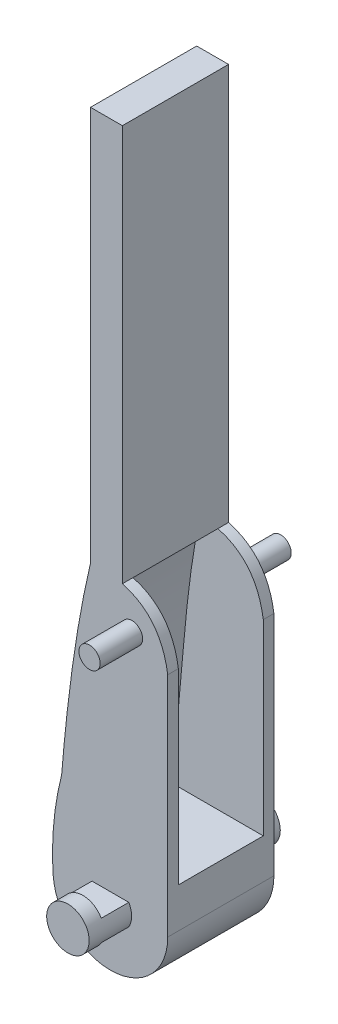
ISO-10303-21;
HEADER;
FILE_DESCRIPTION(('STEP AP214'),'2;1');
FILE_NAME('part.step','',(''),(''),'','','');
FILE_SCHEMA(('AUTOMOTIVE_DESIGN { 1 0 10303 214 1 1 1 1 }'));
ENDSEC;
DATA;
#1=APPLICATION_CONTEXT('core data for automotive mechanical design processes');
#2=APPLICATION_PROTOCOL_DEFINITION('international standard','automotive_design',2000,#1);
#3=PRODUCT_CONTEXT('',#1,'mechanical');
#4=PRODUCT('Part','Part','',(#3));
#5=PRODUCT_RELATED_PRODUCT_CATEGORY('part','',(#4));
#6=PRODUCT_DEFINITION_FORMATION('','',#4);
#7=PRODUCT_DEFINITION_CONTEXT('part definition',#1,'design');
#8=PRODUCT_DEFINITION('design','',#6,#7);
#9=PRODUCT_DEFINITION_SHAPE('','',#8);
#10=(LENGTH_UNIT() NAMED_UNIT(*) SI_UNIT(.MILLI.,.METRE.));
#11=(NAMED_UNIT(*) PLANE_ANGLE_UNIT() SI_UNIT($,.RADIAN.));
#12=(NAMED_UNIT(*) SI_UNIT($,.STERADIAN.) SOLID_ANGLE_UNIT());
#13=UNCERTAINTY_MEASURE_WITH_UNIT(LENGTH_MEASURE(1.E-05),#10,'distance_accuracy_value','');
#14=(GEOMETRIC_REPRESENTATION_CONTEXT(3) GLOBAL_UNCERTAINTY_ASSIGNED_CONTEXT((#13)) GLOBAL_UNIT_ASSIGNED_CONTEXT((#10,
#11,#12)) REPRESENTATION_CONTEXT('',''));
#15=CARTESIAN_POINT('',(0.,0.,0.));
#16=DIRECTION('',(0.,0.,1.));
#17=DIRECTION('',(1.,0.,0.));
#18=AXIS2_PLACEMENT_3D('',#15,#16,#17);
#19=CARTESIAN_POINT('',(-11.,-0.656322645921725,5.));
#20=DIRECTION('',(-1.,0.,0.));
#21=DIRECTION('',(0.,-1.,0.));
#22=AXIS2_PLACEMENT_3D('',#19,#20,#21);
#23=PLANE('',#22);
#24=DIRECTION('',(0.,1.,0.));
#25=VECTOR('',#24,1.);
#26=CARTESIAN_POINT('',(-11.,-0.656322645921725,-5.));
#27=LINE('',#26,#25);
#28=CARTESIAN_POINT('',(-11.,-22.4299752938434,-5.));
#29=VERTEX_POINT('',#28);
#30=CARTESIAN_POINT('',(-11.,-1.03077269497958,-5.));
#31=VERTEX_POINT('',#30);
#32=EDGE_CURVE('E398',#29,#31,#27,.T.);
#33=ORIENTED_EDGE('',*,*,#32,.T.);
#34=DIRECTION('',(0.,0.,1.));
#35=VECTOR('',#34,1.);
#36=CARTESIAN_POINT('',(-11.,-1.03077269497958,-5.));
#37=LINE('',#36,#35);
#38=CARTESIAN_POINT('',(-11.,-1.03077269497958,-4.));
#39=VERTEX_POINT('',#38);
#40=EDGE_CURVE('E495',#31,#39,#37,.T.);
#41=ORIENTED_EDGE('',*,*,#40,.T.);
#42=DIRECTION('',(0.,1.,0.));
#43=VECTOR('',#42,1.);
#44=CARTESIAN_POINT('',(-11.,-0.656322645921725,-4.));
#45=LINE('',#44,#43);
#46=CARTESIAN_POINT('',(-11.,-18.6752377184119,-4.));
#47=VERTEX_POINT('',#46);
#48=EDGE_CURVE('E321',#47,#39,#45,.T.);
#49=ORIENTED_EDGE('',*,*,#48,.F.);
#50=DIRECTION('',(0.,0.,1.));
#51=VECTOR('',#50,1.);
#52=CARTESIAN_POINT('',(-11.,-18.6752377184119,5.));
#53=LINE('',#52,#51);
#54=CARTESIAN_POINT('',(-11.,-18.6752377184119,4.));
#55=VERTEX_POINT('',#54);
#56=EDGE_CURVE('E422',#47,#55,#53,.T.);
#57=ORIENTED_EDGE('',*,*,#56,.T.);
#58=DIRECTION('',(0.,1.,0.));
#59=VECTOR('',#58,1.);
#60=CARTESIAN_POINT('',(-11.,-0.656322645921725,4.));
#61=LINE('',#60,#59);
#62=CARTESIAN_POINT('',(-11.,-1.03077269497958,4.));
#63=VERTEX_POINT('',#62);
#64=EDGE_CURVE('E318',#55,#63,#61,.T.);
#65=ORIENTED_EDGE('',*,*,#64,.T.);
#66=CARTESIAN_POINT('',(-11.,-1.03077269497958,5.));
#67=VERTEX_POINT('',#66);
#68=EDGE_CURVE('E225',#63,#67,#37,.T.);
#69=ORIENTED_EDGE('',*,*,#68,.T.);
#70=DIRECTION('',(0.,1.,0.));
#71=VECTOR('',#70,1.);
#72=CARTESIAN_POINT('',(-11.,-0.656322645921725,5.));
#73=LINE('',#72,#71);
#74=CARTESIAN_POINT('',(-11.,-22.4299752938434,5.));
#75=VERTEX_POINT('',#74);
#76=EDGE_CURVE('E354',#75,#67,#73,.T.);
#77=ORIENTED_EDGE('',*,*,#76,.F.);
#78=DIRECTION('',(0.,0.,-1.));
#79=VECTOR('',#78,1.);
#80=CARTESIAN_POINT('',(-11.,-22.4299752938434,5.));
#81=LINE('',#80,#79);
#82=EDGE_CURVE('E392',#75,#29,#81,.T.);
#83=ORIENTED_EDGE('',*,*,#82,.T.);
#84=EDGE_LOOP('',(#33,#41,#49,#57,#65,#69,#77,#83));
#85=FACE_BOUND('',#84,.T.);
#86=ADVANCED_FACE('F34',(#85),#23,.F.);
#87=CARTESIAN_POINT('',(-20.9921297127264,-14.1977933045185,5.));
#88=CARTESIAN_POINT('',(-22.0839851919161,-18.5085470691926,5.));
#89=CARTESIAN_POINT('',(-21.7863253717624,-22.8033144090123,5.));
#90=B_SPLINE_CURVE_WITH_KNOTS('',2,(#87,#88,#89),.UNSPECIFIED.,.F.,.F.,(3,3),(0.,
0.849528988523123),.UNSPECIFIED.);
#91=DIRECTION('',(0.,0.,-1.));
#92=VECTOR('',#91,1.);
#93=SURFACE_OF_LINEAR_EXTRUSION('',#90,#92);
#94=CARTESIAN_POINT('',(-20.9921297127264,-14.1977933045185,-5.));
#95=CARTESIAN_POINT('',(-22.0839851919161,-18.5085470691926,-5.));
#96=CARTESIAN_POINT('',(-21.7863253717624,-22.8033144090123,-5.));
#97=B_SPLINE_CURVE_WITH_KNOTS('',2,(#94,#95,#96),.UNSPECIFIED.,.F.,.F.,(3,3),(0.,
0.849528988523123),.UNSPECIFIED.);
#98=CARTESIAN_POINT('',(-20.9921297127264,-14.1977933045185,-5.));
#99=VERTEX_POINT('',#98);
#100=CARTESIAN_POINT('',(-21.7863253717624,-22.8033144090123,-5.));
#101=VERTEX_POINT('',#100);
#102=EDGE_CURVE('E342',#99,#101,#97,.T.);
#103=ORIENTED_EDGE('',*,*,#102,.T.);
#104=DIRECTION('',(0.,0.,-1.));
#105=VECTOR('',#104,1.);
#106=CARTESIAN_POINT('',(-21.7863253717624,-22.8033144090123,5.));
#107=LINE('',#106,#105);
#108=CARTESIAN_POINT('',(-21.7863253717624,-22.8033144090123,5.));
#109=VERTEX_POINT('',#108);
#110=EDGE_CURVE('E395',#109,#101,#107,.T.);
#111=ORIENTED_EDGE('',*,*,#110,.F.);
#112=CARTESIAN_POINT('',(-20.9921297127264,-14.1977933045185,5.));
#113=VERTEX_POINT('',#112);
#114=EDGE_CURVE('E343',#113,#109,#90,.T.);
#115=ORIENTED_EDGE('',*,*,#114,.F.);
#116=DIRECTION('',(0.,0.,-1.));
#117=VECTOR('',#116,1.);
#118=CARTESIAN_POINT('',(-20.9921297127264,-14.1977933045185,5.));
#119=LINE('',#118,#117);
#120=EDGE_CURVE('E362',#113,#99,#119,.T.);
#121=ORIENTED_EDGE('',*,*,#120,.T.);
#122=EDGE_LOOP('',(#103,#111,#115,#121));
#123=FACE_BOUND('',#122,.T.);
#124=ADVANCED_FACE('F36',(#123),#93,.F.);
#125=CARTESIAN_POINT('',(-16.3996237414358,-22.4299752938434,5.));
#126=DIRECTION('',(0.,0.,-1.));
#127=DIRECTION('',(-1.,0.,0.));
#128=AXIS2_PLACEMENT_3D('',#125,#126,#127);
#129=CYLINDRICAL_SURFACE('',#128,5.39962374143584);
#130=CARTESIAN_POINT('',(-16.3996237414358,-22.4299752938434,-5.));
#131=DIRECTION('',(0.,0.,1.));
#132=DIRECTION('',(1.,0.,0.));
#133=AXIS2_PLACEMENT_3D('',#130,#131,#132);
#134=CIRCLE('',#133,5.39962374143584);
#135=EDGE_CURVE('E389',#101,#29,#134,.T.);
#136=ORIENTED_EDGE('',*,*,#135,.T.);
#137=ORIENTED_EDGE('',*,*,#82,.F.);
#138=CARTESIAN_POINT('',(-16.3996237414358,-22.4299752938434,5.));
#139=DIRECTION('',(0.,0.,1.));
#140=DIRECTION('',(1.,0.,0.));
#141=AXIS2_PLACEMENT_3D('',#138,#139,#140);
#142=CIRCLE('',#141,5.39962374143584);
#143=EDGE_CURVE('E348',#109,#75,#142,.T.);
#144=ORIENTED_EDGE('',*,*,#143,.F.);
#145=ORIENTED_EDGE('',*,*,#110,.T.);
#146=EDGE_LOOP('',(#136,#137,#144,#145));
#147=FACE_BOUND('',#146,.T.);
#148=ADVANCED_FACE('F375',(#147),#129,.T.);
#149=CARTESIAN_POINT('',(-5.10108349086464,23.2685571642565,5.));
#150=CARTESIAN_POINT('',(-16.9112950324598,22.3154033080053,5.));
#151=CARTESIAN_POINT('',(-19.9824776136848,-1.83524633930493,5.));
#152=CARTESIAN_POINT('',(-20.9921297127264,-14.1977933045185,5.));
#153=B_SPLINE_CURVE_WITH_KNOTS('',3,(#149,#150,#151,#152),.UNSPECIFIED.,.F.,.F.,(4,4),
(0.325260196071172,1.),.UNSPECIFIED.);
#154=DIRECTION('',(0.,0.,-1.));
#155=VECTOR('',#154,1.);
#156=SURFACE_OF_LINEAR_EXTRUSION('',#153,#155);
#157=CARTESIAN_POINT('',(-18.2712496040087,4.45336928753047,5.));
#158=VERTEX_POINT('',#157);
#159=EDGE_CURVE('E357',#158,#113,#153,.T.);
#160=ORIENTED_EDGE('',*,*,#159,.F.);
#161=DIRECTION('',(0.,0.,-1.));
#162=VECTOR('',#161,1.);
#163=CARTESIAN_POINT('',(-18.2712496040087,4.45336928753047,5.));
#164=LINE('',#163,#162);
#165=CARTESIAN_POINT('',(-18.2712496040087,4.45336928753047,-5.));
#166=VERTEX_POINT('',#165);
#167=EDGE_CURVE('E471',#158,#166,#164,.T.);
#168=ORIENTED_EDGE('',*,*,#167,.T.);
#169=CARTESIAN_POINT('',(-5.10108349086464,23.2685571642565,-5.));
#170=CARTESIAN_POINT('',(-16.9112950324598,22.3154033080053,-5.));
#171=CARTESIAN_POINT('',(-19.9824776136848,-1.83524633930493,-5.));
#172=CARTESIAN_POINT('',(-20.9921297127264,-14.1977933045185,-5.));
#173=B_SPLINE_CURVE_WITH_KNOTS('',3,(#169,#170,#171,#172),.UNSPECIFIED.,.F.,.F.,(4,4),
(0.325260196071172,1.),.UNSPECIFIED.);
#174=EDGE_CURVE('E349',#166,#99,#173,.T.);
#175=ORIENTED_EDGE('',*,*,#174,.T.);
#176=ORIENTED_EDGE('',*,*,#120,.F.);
#177=EDGE_LOOP('',(#160,#168,#175,#176));
#178=FACE_BOUND('',#177,.T.);
#179=ADVANCED_FACE('F370',(#178),#156,.F.);
#180=CARTESIAN_POINT('',(-21.7366063670802,-18.504550462979,5.));
#181=DIRECTION('',(0.,0.,-1.));
#182=DIRECTION('',(-1.,0.,0.));
#183=AXIS2_PLACEMENT_3D('',#180,#181,#182);
#184=PLANE('',#183);
#185=DIRECTION('',(1.,0.,0.));
#186=VECTOR('',#185,1.);
#187=CARTESIAN_POINT('',(-21.9351552818392,-23.4299752938434,5.));
#188=LINE('',#187,#186);
#189=CARTESIAN_POINT('',(-18.1316745490047,-23.4299752938434,5.));
#190=VERTEX_POINT('',#189);
#191=CARTESIAN_POINT('',(-14.667572933867,-23.4299752938434,5.));
#192=VERTEX_POINT('',#191);
#193=EDGE_CURVE('E460',#190,#192,#188,.T.);
#194=ORIENTED_EDGE('',*,*,#193,.F.);
#195=CARTESIAN_POINT('',(-16.3996237414358,-22.4299752938434,5.));
#196=DIRECTION('',(0.,0.,-1.));
#197=DIRECTION('',(-1.,0.,0.));
#198=AXIS2_PLACEMENT_3D('',#195,#196,#197);
#199=CIRCLE('',#198,2.);
#200=CARTESIAN_POINT('',(-18.1316745490047,-21.4299752938434,5.));
#201=VERTEX_POINT('',#200);
#202=EDGE_CURVE('E339',#190,#201,#199,.T.);
#203=ORIENTED_EDGE('',*,*,#202,.T.);
#204=DIRECTION('',(1.,0.,0.));
#205=VECTOR('',#204,1.);
#206=CARTESIAN_POINT('',(-21.9351552818392,-21.4299752938434,5.));
#207=LINE('',#206,#205);
#208=CARTESIAN_POINT('',(-14.667572933867,-21.4299752938434,5.));
#209=VERTEX_POINT('',#208);
#210=EDGE_CURVE('E310',#201,#209,#207,.T.);
#211=ORIENTED_EDGE('',*,*,#210,.T.);
#212=EDGE_CURVE('E340',#209,#192,#199,.T.);
#213=ORIENTED_EDGE('',*,*,#212,.T.);
#214=EDGE_LOOP('',(#194,#203,#211,#213));
#215=FACE_BOUND('',#214,.T.);
#216=CARTESIAN_POINT('',(-16.2381986635091,4.45336928753047,5.));
#217=CARTESIAN_POINT('',(-11.7179559230155,3.79711098432976,5.));
#218=CARTESIAN_POINT('',(-11.,-1.03077269497958,5.));
#219=B_SPLINE_CURVE_WITH_KNOTS('',2,(#216,#217,#218),.UNSPECIFIED.,.F.,.F.,(3,3),(0.,1.),.UNSPECIFIED.);
#220=CARTESIAN_POINT('',(-15.2712495973123,4.25345907970468,5.));
#221=VERTEX_POINT('',#220);
#222=EDGE_CURVE('E219',#221,#67,#219,.T.);
#223=ORIENTED_EDGE('',*,*,#222,.F.);
#224=DIRECTION('',(1.84401730891246E-10,1.,0.));
#225=VECTOR('',#224,1.);
#226=CARTESIAN_POINT('',(-15.2712495971189,41.6163615269056,5.));
#227=LINE('',#226,#225);
#228=CARTESIAN_POINT('',(-15.2712495971189,41.6163615269056,5.));
#229=VERTEX_POINT('',#228);
#230=EDGE_CURVE('E50',#221,#229,#227,.T.);
#231=ORIENTED_EDGE('',*,*,#230,.T.);
#232=DIRECTION('',(-1.,0.,0.));
#233=VECTOR('',#232,1.);
#234=CARTESIAN_POINT('',(-18.2712496040087,41.6163615269056,5.));
#235=LINE('',#234,#233);
#236=CARTESIAN_POINT('',(-18.2712496040087,41.6163615269056,5.));
#237=VERTEX_POINT('',#236);
#238=EDGE_CURVE('E193',#229,#237,#235,.T.);
#239=ORIENTED_EDGE('',*,*,#238,.T.);
#240=DIRECTION('',(0.,-1.,0.));
#241=VECTOR('',#240,1.);
#242=CARTESIAN_POINT('',(-18.2712496040087,4.45336928753047,5.));
#243=LINE('',#242,#241);
#244=EDGE_CURVE('E200',#237,#158,#243,.T.);
#245=ORIENTED_EDGE('',*,*,#244,.T.);
#246=ORIENTED_EDGE('',*,*,#159,.T.);
#247=ORIENTED_EDGE('',*,*,#114,.T.);
#248=ORIENTED_EDGE('',*,*,#143,.T.);
#249=ORIENTED_EDGE('',*,*,#76,.T.);
#250=EDGE_LOOP('',(#223,#231,#239,#245,#246,#247,#248,#249));
#251=FACE_BOUND('',#250,.T.);
#252=CARTESIAN_POINT('',(-14.3665318566689,0.706079338072968,5.));
#253=DIRECTION('',(0.,0.,-1.));
#254=DIRECTION('',(-1.,0.,0.));
#255=AXIS2_PLACEMENT_3D('',#252,#253,#254);
#256=CIRCLE('',#255,1.);
#257=CARTESIAN_POINT('',(-15.3665318566689,0.706079338072968,5.));
#258=VERTEX_POINT('',#257);
#259=EDGE_CURVE('E330',#258,#258,#256,.T.);
#260=ORIENTED_EDGE('',*,*,#259,.T.);
#261=EDGE_LOOP('',(#260));
#262=FACE_BOUND('',#261,.T.);
#263=ADVANCED_FACE('F374',(#215,#251,#262),#184,.F.);
#264=CARTESIAN_POINT('',(-21.7366063670802,-18.504550462979,-5.));
#265=DIRECTION('',(0.,0.,-1.));
#266=DIRECTION('',(-1.,0.,0.));
#267=AXIS2_PLACEMENT_3D('',#264,#265,#266);
#268=PLANE('',#267);
#269=ORIENTED_EDGE('',*,*,#174,.F.);
#270=DIRECTION('',(0.,-1.,0.));
#271=VECTOR('',#270,1.);
#272=CARTESIAN_POINT('',(-18.2712496040087,4.45336928753047,-5.));
#273=LINE('',#272,#271);
#274=CARTESIAN_POINT('',(-18.2712496040087,41.6163615269056,-5.));
#275=VERTEX_POINT('',#274);
#276=EDGE_CURVE('E184',#275,#166,#273,.T.);
#277=ORIENTED_EDGE('',*,*,#276,.F.);
#278=DIRECTION('',(-1.,0.,0.));
#279=VECTOR('',#278,1.);
#280=CARTESIAN_POINT('',(-18.2712496040087,41.6163615269056,-5.));
#281=LINE('',#280,#279);
#282=CARTESIAN_POINT('',(-15.2712495971189,41.6163615269056,-5.));
#283=VERTEX_POINT('',#282);
#284=EDGE_CURVE('E176',#283,#275,#281,.T.);
#285=ORIENTED_EDGE('',*,*,#284,.F.);
#286=DIRECTION('',(1.84401730891246E-10,1.,0.));
#287=VECTOR('',#286,1.);
#288=CARTESIAN_POINT('',(-15.2712495971189,41.6163615269056,-5.));
#289=LINE('',#288,#287);
#290=CARTESIAN_POINT('',(-15.2712496040087,4.2534590801509,-5.));
#291=VERTEX_POINT('',#290);
#292=EDGE_CURVE('E182',#291,#283,#289,.T.);
#293=ORIENTED_EDGE('',*,*,#292,.F.);
#294=CARTESIAN_POINT('',(-16.2381986635091,4.45336928753047,-5.));
#295=CARTESIAN_POINT('',(-11.7179559230155,3.79711098432976,-5.));
#296=CARTESIAN_POINT('',(-11.,-1.03077269497958,-5.));
#297=B_SPLINE_CURVE_WITH_KNOTS('',2,(#294,#295,#296),.UNSPECIFIED.,.F.,.F.,(3,3),(0.,1.),.UNSPECIFIED.);
#298=EDGE_CURVE('E220',#291,#31,#297,.T.);
#299=ORIENTED_EDGE('',*,*,#298,.T.);
#300=ORIENTED_EDGE('',*,*,#32,.F.);
#301=ORIENTED_EDGE('',*,*,#135,.F.);
#302=ORIENTED_EDGE('',*,*,#102,.F.);
#303=EDGE_LOOP('',(#269,#277,#285,#293,#299,#300,#301,#302));
#304=FACE_BOUND('',#303,.T.);
#305=CARTESIAN_POINT('',(-16.3996237414358,-22.4299752938434,-5.));
#306=DIRECTION('',(0.,0.,-1.));
#307=DIRECTION('',(-1.,0.,0.));
#308=AXIS2_PLACEMENT_3D('',#305,#306,#307);
#309=CIRCLE('',#308,2.);
#310=CARTESIAN_POINT('',(-18.1316745490047,-23.4299752938434,-5.));
#311=VERTEX_POINT('',#310);
#312=CARTESIAN_POINT('',(-18.1316745490047,-21.4299752938434,-5.));
#313=VERTEX_POINT('',#312);
#314=EDGE_CURVE('E415',#311,#313,#309,.T.);
#315=ORIENTED_EDGE('',*,*,#314,.F.);
#316=DIRECTION('',(1.,0.,0.));
#317=VECTOR('',#316,1.);
#318=CARTESIAN_POINT('',(-21.9351552818392,-23.4299752938434,-5.));
#319=LINE('',#318,#317);
#320=CARTESIAN_POINT('',(-14.667572933867,-23.4299752938434,-5.));
#321=VERTEX_POINT('',#320);
#322=EDGE_CURVE('E451',#311,#321,#319,.T.);
#323=ORIENTED_EDGE('',*,*,#322,.T.);
#324=CARTESIAN_POINT('',(-14.667572933867,-21.4299752938434,-5.));
#325=VERTEX_POINT('',#324);
#326=EDGE_CURVE('E418',#325,#321,#309,.T.);
#327=ORIENTED_EDGE('',*,*,#326,.F.);
#328=DIRECTION('',(1.,0.,0.));
#329=VECTOR('',#328,1.);
#330=CARTESIAN_POINT('',(-21.9351552818392,-21.4299752938434,-5.));
#331=LINE('',#330,#329);
#332=EDGE_CURVE('E470',#313,#325,#331,.T.);
#333=ORIENTED_EDGE('',*,*,#332,.F.);
#334=EDGE_LOOP('',(#315,#323,#327,#333));
#335=FACE_BOUND('',#334,.T.);
#336=CARTESIAN_POINT('',(-14.3665318566689,0.706079338072968,-5.));
#337=DIRECTION('',(0.,0.,-1.));
#338=DIRECTION('',(-1.,0.,0.));
#339=AXIS2_PLACEMENT_3D('',#336,#337,#338);
#340=CIRCLE('',#339,1.);
#341=CARTESIAN_POINT('',(-15.3665318566689,0.706079338072968,-5.));
#342=VERTEX_POINT('',#341);
#343=EDGE_CURVE('E419',#342,#342,#340,.T.);
#344=ORIENTED_EDGE('',*,*,#343,.F.);
#345=EDGE_LOOP('',(#344));
#346=FACE_BOUND('',#345,.T.);
#347=ADVANCED_FACE('F179',(#304,#335,#346),#268,.T.);
#348=CARTESIAN_POINT('',(-16.3996237414358,-22.4299752938434,-9.));
#349=DIRECTION('',(0.,0.,1.));
#350=DIRECTION('',(1.,0.,0.));
#351=AXIS2_PLACEMENT_3D('',#348,#349,#350);
#352=PLANE('',#351);
#353=CARTESIAN_POINT('',(-16.3996237414358,-22.4299752938434,-9.));
#354=DIRECTION('',(0.,0.,1.));
#355=DIRECTION('',(1.,0.,0.));
#356=AXIS2_PLACEMENT_3D('',#353,#354,#355);
#357=CIRCLE('',#356,2.);
#358=CARTESIAN_POINT('',(-14.3996237414358,-22.4299752938434,-9.));
#359=VERTEX_POINT('',#358);
#360=EDGE_CURVE('E336',#359,#359,#357,.T.);
#361=ORIENTED_EDGE('',*,*,#360,.F.);
#362=EDGE_LOOP('',(#361));
#363=FACE_BOUND('',#362,.T.);
#364=ADVANCED_FACE('F643',(#363),#352,.F.);
#365=CARTESIAN_POINT('',(-16.3996237414358,-22.4299752938434,-9.));
#366=DIRECTION('',(0.,0.,1.));
#367=DIRECTION('',(1.,0.,0.));
#368=AXIS2_PLACEMENT_3D('',#365,#366,#367);
#369=CYLINDRICAL_SURFACE('',#368,2.);
#370=DIRECTION('',(0.,0.,1.));
#371=VECTOR('',#370,1.);
#372=CARTESIAN_POINT('',(-18.1316745490047,-23.4299752938434,-9.));
#373=LINE('',#372,#371);
#374=CARTESIAN_POINT('',(-18.1316745490047,-23.4299752938434,-7.5910190600558));
#375=VERTEX_POINT('',#374);
#376=EDGE_CURVE('E43',#311,#375,#373,.F.);
#377=ORIENTED_EDGE('',*,*,#376,.F.);
#378=ORIENTED_EDGE('',*,*,#314,.T.);
#379=DIRECTION('',(0.,0.,1.));
#380=VECTOR('',#379,1.);
#381=CARTESIAN_POINT('',(-18.1316745490047,-21.4299752938434,-9.));
#382=LINE('',#381,#380);
#383=CARTESIAN_POINT('',(-18.1316745490047,-21.4299752938434,-7.5910190600558));
#384=VERTEX_POINT('',#383);
#385=EDGE_CURVE('E437',#384,#313,#382,.T.);
#386=ORIENTED_EDGE('',*,*,#385,.F.);
#387=CARTESIAN_POINT('',(-16.3996237414358,-22.4299752938434,-7.5910190600558));
#388=DIRECTION('',(0.,0.,-1.));
#389=DIRECTION('',(-1.,0.,0.));
#390=AXIS2_PLACEMENT_3D('',#387,#388,#389);
#391=CIRCLE('',#390,2.);
#392=CARTESIAN_POINT('',(-14.667572933867,-21.4299752938434,-7.5910190600558));
#393=VERTEX_POINT('',#392);
#394=EDGE_CURVE('E440',#393,#384,#391,.F.);
#395=ORIENTED_EDGE('',*,*,#394,.F.);
#396=DIRECTION('',(0.,0.,1.));
#397=VECTOR('',#396,1.);
#398=CARTESIAN_POINT('',(-14.667572933867,-21.4299752938434,-9.));
#399=LINE('',#398,#397);
#400=EDGE_CURVE('E442',#325,#393,#399,.F.);
#401=ORIENTED_EDGE('',*,*,#400,.F.);
#402=ORIENTED_EDGE('',*,*,#326,.T.);
#403=DIRECTION('',(0.,0.,1.));
#404=VECTOR('',#403,1.);
#405=CARTESIAN_POINT('',(-14.667572933867,-23.4299752938434,-9.));
#406=LINE('',#405,#404);
#407=CARTESIAN_POINT('',(-14.667572933867,-23.4299752938434,-7.5910190600558));
#408=VERTEX_POINT('',#407);
#409=EDGE_CURVE('E446',#408,#321,#406,.T.);
#410=ORIENTED_EDGE('',*,*,#409,.F.);
#411=CARTESIAN_POINT('',(-16.3996237414358,-22.4299752938434,-7.5910190600558));
#412=DIRECTION('',(0.,0.,-1.));
#413=DIRECTION('',(-1.,0.,0.));
#414=AXIS2_PLACEMENT_3D('',#411,#412,#413);
#415=CIRCLE('',#414,2.);
#416=EDGE_CURVE('E444',#375,#408,#415,.F.);
#417=ORIENTED_EDGE('',*,*,#416,.F.);
#418=EDGE_LOOP('',(#377,#378,#386,#395,#401,#402,#410,#417));
#419=FACE_BOUND('',#418,.T.);
#420=ORIENTED_EDGE('',*,*,#360,.T.);
#421=EDGE_LOOP('',(#420));
#422=FACE_BOUND('',#421,.T.);
#423=ADVANCED_FACE('F454',(#419,#422),#369,.T.);
#424=DIRECTION('',(0.,0.,1.));
#425=VECTOR('',#424,1.);
#426=CARTESIAN_POINT('',(-18.1316745490047,-23.4299752938434,-9.));
#427=LINE('',#426,#425);
#428=CARTESIAN_POINT('',(-18.1316745490047,-23.4299752938434,7.5910190600558));
#429=VERTEX_POINT('',#428);
#430=EDGE_CURVE('E435',#429,#190,#427,.F.);
#431=ORIENTED_EDGE('',*,*,#430,.F.);
#432=CARTESIAN_POINT('',(-16.3996237414358,-22.4299752938434,7.5910190600558));
#433=DIRECTION('',(0.,0.,1.));
#434=DIRECTION('',(1.,0.,0.));
#435=AXIS2_PLACEMENT_3D('',#432,#433,#434);
#436=CIRCLE('',#435,2.);
#437=CARTESIAN_POINT('',(-14.667572933867,-23.4299752938434,7.5910190600558));
#438=VERTEX_POINT('',#437);
#439=EDGE_CURVE('E433',#438,#429,#436,.F.);
#440=ORIENTED_EDGE('',*,*,#439,.F.);
#441=DIRECTION('',(0.,0.,1.));
#442=VECTOR('',#441,1.);
#443=CARTESIAN_POINT('',(-14.667572933867,-23.4299752938434,-9.));
#444=LINE('',#443,#442);
#445=EDGE_CURVE('E431',#192,#438,#444,.T.);
#446=ORIENTED_EDGE('',*,*,#445,.F.);
#447=ORIENTED_EDGE('',*,*,#212,.F.);
#448=DIRECTION('',(0.,0.,1.));
#449=VECTOR('',#448,1.);
#450=CARTESIAN_POINT('',(-14.667572933867,-21.4299752938434,-9.));
#451=LINE('',#450,#449);
#452=CARTESIAN_POINT('',(-14.667572933867,-21.4299752938434,7.5910190600558));
#453=VERTEX_POINT('',#452);
#454=EDGE_CURVE('E429',#453,#209,#451,.F.);
#455=ORIENTED_EDGE('',*,*,#454,.F.);
#456=CARTESIAN_POINT('',(-16.3996237414358,-22.4299752938434,7.5910190600558));
#457=DIRECTION('',(0.,0.,1.));
#458=DIRECTION('',(1.,0.,0.));
#459=AXIS2_PLACEMENT_3D('',#456,#457,#458);
#460=CIRCLE('',#459,2.);
#461=CARTESIAN_POINT('',(-18.1316745490047,-21.4299752938434,7.5910190600558));
#462=VERTEX_POINT('',#461);
#463=EDGE_CURVE('E427',#462,#453,#460,.F.);
#464=ORIENTED_EDGE('',*,*,#463,.F.);
#465=DIRECTION('',(0.,0.,1.));
#466=VECTOR('',#465,1.);
#467=CARTESIAN_POINT('',(-18.1316745490047,-21.4299752938434,-9.));
#468=LINE('',#467,#466);
#469=EDGE_CURVE('E425',#201,#462,#468,.T.);
#470=ORIENTED_EDGE('',*,*,#469,.F.);
#471=ORIENTED_EDGE('',*,*,#202,.F.);
#472=EDGE_LOOP('',(#431,#440,#446,#447,#455,#464,#470,#471));
#473=FACE_BOUND('',#472,.T.);
#474=CARTESIAN_POINT('',(-16.3996237414358,-22.4299752938434,9.));
#475=DIRECTION('',(0.,0.,1.));
#476=DIRECTION('',(1.,0.,0.));
#477=AXIS2_PLACEMENT_3D('',#474,#475,#476);
#478=CIRCLE('',#477,2.);
#479=CARTESIAN_POINT('',(-14.3996237414358,-22.4299752938434,9.));
#480=VERTEX_POINT('',#479);
#481=EDGE_CURVE('E333',#480,#480,#478,.T.);
#482=ORIENTED_EDGE('',*,*,#481,.F.);
#483=EDGE_LOOP('',(#482));
#484=FACE_BOUND('',#483,.T.);
#485=ADVANCED_FACE('F628',(#473,#484),#369,.T.);
#486=CARTESIAN_POINT('',(-16.3996237414358,-22.4299752938434,9.));
#487=DIRECTION('',(0.,0.,1.));
#488=DIRECTION('',(1.,0.,0.));
#489=AXIS2_PLACEMENT_3D('',#486,#487,#488);
#490=PLANE('',#489);
#491=ORIENTED_EDGE('',*,*,#481,.T.);
#492=EDGE_LOOP('',(#491));
#493=FACE_BOUND('',#492,.T.);
#494=ADVANCED_FACE('F621',(#493),#490,.T.);
#495=CARTESIAN_POINT('',(-14.3665318566689,0.706079338072968,-9.));
#496=DIRECTION('',(0.,0.,1.));
#497=DIRECTION('',(1.,0.,0.));
#498=AXIS2_PLACEMENT_3D('',#495,#496,#497);
#499=PLANE('',#498);
#500=CARTESIAN_POINT('',(-14.3665318566689,0.706079338072968,-9.));
#501=DIRECTION('',(0.,0.,1.));
#502=DIRECTION('',(1.,0.,0.));
#503=AXIS2_PLACEMENT_3D('',#500,#501,#502);
#504=CIRCLE('',#503,1.);
#505=CARTESIAN_POINT('',(-13.3665318566689,0.706079338072968,-9.));
#506=VERTEX_POINT('',#505);
#507=EDGE_CURVE('E327',#506,#506,#504,.T.);
#508=ORIENTED_EDGE('',*,*,#507,.F.);
#509=EDGE_LOOP('',(#508));
#510=FACE_BOUND('',#509,.T.);
#511=ADVANCED_FACE('F614',(#510),#499,.F.);
#512=CARTESIAN_POINT('',(-14.3665318566689,0.706079338072968,-9.));
#513=DIRECTION('',(0.,0.,1.));
#514=DIRECTION('',(1.,0.,0.));
#515=AXIS2_PLACEMENT_3D('',#512,#513,#514);
#516=CYLINDRICAL_SURFACE('',#515,1.);
#517=ORIENTED_EDGE('',*,*,#343,.T.);
#518=EDGE_LOOP('',(#517));
#519=FACE_BOUND('',#518,.T.);
#520=ORIENTED_EDGE('',*,*,#507,.T.);
#521=EDGE_LOOP('',(#520));
#522=FACE_BOUND('',#521,.T.);
#523=ADVANCED_FACE('F606',(#519,#522),#516,.T.);
#524=CARTESIAN_POINT('',(-14.3665318566689,0.706079338072968,9.));
#525=DIRECTION('',(0.,0.,1.));
#526=DIRECTION('',(1.,0.,0.));
#527=AXIS2_PLACEMENT_3D('',#524,#525,#526);
#528=CIRCLE('',#527,1.);
#529=CARTESIAN_POINT('',(-13.3665318566689,0.706079338072968,9.));
#530=VERTEX_POINT('',#529);
#531=EDGE_CURVE('E324',#530,#530,#528,.T.);
#532=ORIENTED_EDGE('',*,*,#531,.F.);
#533=EDGE_LOOP('',(#532));
#534=FACE_BOUND('',#533,.T.);
#535=ORIENTED_EDGE('',*,*,#259,.F.);
#536=EDGE_LOOP('',(#535));
#537=FACE_BOUND('',#536,.T.);
#538=ADVANCED_FACE('F599',(#534,#537),#516,.T.);
#539=CARTESIAN_POINT('',(-14.3665318566689,0.706079338072968,9.));
#540=DIRECTION('',(0.,0.,1.));
#541=DIRECTION('',(1.,0.,0.));
#542=AXIS2_PLACEMENT_3D('',#539,#540,#541);
#543=PLANE('',#542);
#544=ORIENTED_EDGE('',*,*,#531,.T.);
#545=EDGE_LOOP('',(#544));
#546=FACE_BOUND('',#545,.T.);
#547=ADVANCED_FACE('F283',(#546),#543,.T.);
#548=CARTESIAN_POINT('',(-19.7286529001781,-18.6752377184119,-4.));
#549=DIRECTION('',(0.,-1.,0.));
#550=DIRECTION('',(1.,0.,0.));
#551=AXIS2_PLACEMENT_3D('',#548,#549,#550);
#552=PLANE('',#551);
#553=DIRECTION('',(1.,0.,0.));
#554=VECTOR('',#553,1.);
#555=CARTESIAN_POINT('',(-19.7286529001781,-18.6752377184119,-4.));
#556=LINE('',#555,#554);
#557=CARTESIAN_POINT('',(-19.7286529001781,-18.6752377184119,-4.));
#558=VERTEX_POINT('',#557);
#559=EDGE_CURVE('E296',#558,#47,#556,.T.);
#560=ORIENTED_EDGE('',*,*,#559,.F.);
#561=DIRECTION('',(0.,0.,1.));
#562=VECTOR('',#561,1.);
#563=CARTESIAN_POINT('',(-19.7286529001781,-18.6752377184119,-4.));
#564=LINE('',#563,#562);
#565=CARTESIAN_POINT('',(-19.7286529001781,-18.6752377184119,4.));
#566=VERTEX_POINT('',#565);
#567=EDGE_CURVE('E305',#558,#566,#564,.T.);
#568=ORIENTED_EDGE('',*,*,#567,.T.);
#569=DIRECTION('',(1.,0.,0.));
#570=VECTOR('',#569,1.);
#571=CARTESIAN_POINT('',(-19.7286529001781,-18.6752377184119,4.));
#572=LINE('',#571,#570);
#573=EDGE_CURVE('E297',#566,#55,#572,.T.);
#574=ORIENTED_EDGE('',*,*,#573,.T.);
#575=ORIENTED_EDGE('',*,*,#56,.F.);
#576=EDGE_LOOP('',(#560,#568,#574,#575));
#577=FACE_BOUND('',#576,.T.);
#578=ADVANCED_FACE('F276',(#577),#552,.F.);
#579=CARTESIAN_POINT('',(18.0915428277824,-2.68390364497333,-4.));
#580=DIRECTION('',(0.,0.,1.));
#581=DIRECTION('',(1.,0.,0.));
#582=AXIS2_PLACEMENT_3D('',#579,#580,#581);
#583=PLANE('',#582);
#584=DIRECTION('',(0.997787139580031,-0.0664892779980354,0.));
#585=VECTOR('',#584,1.);
#586=CARTESIAN_POINT('',(18.4042913256118,2.00943095653109,-4.));
#587=LINE('',#586,#585);
#588=CARTESIAN_POINT('',(-16.9608772619745,4.36605035198364,-4.));
#589=VERTEX_POINT('',#588);
#590=CARTESIAN_POINT('',(-15.2712496040087,4.2534590801509,-4.));
#591=VERTEX_POINT('',#590);
#592=EDGE_CURVE('E217',#589,#591,#587,.T.);
#593=ORIENTED_EDGE('',*,*,#592,.F.);
#594=CARTESIAN_POINT('',(-14.1606358795704,12.808117780827,-4.));
#595=CARTESIAN_POINT('',(-18.7957472997761,3.01238975300453,-4.));
#596=CARTESIAN_POINT('',(-18.1519373143941,-8.21375949373844,-4.));
#597=CARTESIAN_POINT('',(-19.7286529001781,-18.6752377184119,-4.));
#598=B_SPLINE_CURVE_WITH_KNOTS('',3,(#594,#595,#596,#597),.UNSPECIFIED.,.F.,.F.,(4,4),(0.,1.),.UNSPECIFIED.);
#599=EDGE_CURVE('E290',#589,#558,#598,.T.);
#600=ORIENTED_EDGE('',*,*,#599,.T.);
#601=ORIENTED_EDGE('',*,*,#559,.T.);
#602=ORIENTED_EDGE('',*,*,#48,.T.);
#603=CARTESIAN_POINT('',(-16.2381986635091,4.45336928753047,-4.));
#604=CARTESIAN_POINT('',(-11.7179559230155,3.79711098432976,-4.));
#605=CARTESIAN_POINT('',(-11.,-1.03077269497958,-4.));
#606=B_SPLINE_CURVE_WITH_KNOTS('',2,(#603,#604,#605),.UNSPECIFIED.,.F.,.F.,(3,3),(0.,1.),.UNSPECIFIED.);
#607=EDGE_CURVE('E485',#591,#39,#606,.T.);
#608=ORIENTED_EDGE('',*,*,#607,.F.);
#609=EDGE_LOOP('',(#593,#600,#601,#602,#608));
#610=FACE_BOUND('',#609,.T.);
#611=ADVANCED_FACE('F272',(#610),#583,.T.);
#612=CARTESIAN_POINT('',(18.0915428277824,-2.68390364497333,4.));
#613=DIRECTION('',(0.,0.,1.));
#614=DIRECTION('',(1.,0.,0.));
#615=AXIS2_PLACEMENT_3D('',#612,#613,#614);
#616=PLANE('',#615);
#617=CARTESIAN_POINT('',(-14.1606358795704,12.808117780827,4.));
#618=CARTESIAN_POINT('',(-18.7957472997761,3.01238975300453,4.));
#619=CARTESIAN_POINT('',(-18.1519373143941,-8.21375949373844,4.));
#620=CARTESIAN_POINT('',(-19.7286529001781,-18.6752377184119,4.));
#621=B_SPLINE_CURVE_WITH_KNOTS('',3,(#617,#618,#619,#620),.UNSPECIFIED.,.F.,.F.,(4,4),(0.,1.),.UNSPECIFIED.);
#622=CARTESIAN_POINT('',(-16.9608772619745,4.36605035198364,4.));
#623=VERTEX_POINT('',#622);
#624=EDGE_CURVE('E306',#623,#566,#621,.T.);
#625=ORIENTED_EDGE('',*,*,#624,.F.);
#626=DIRECTION('',(0.997787139580031,-0.0664892779980354,0.));
#627=VECTOR('',#626,1.);
#628=CARTESIAN_POINT('',(18.4042913256118,2.00943095653109,4.));
#629=LINE('',#628,#627);
#630=CARTESIAN_POINT('',(-15.2712496040087,4.2534590801509,4.));
#631=VERTEX_POINT('',#630);
#632=EDGE_CURVE('E214',#623,#631,#629,.T.);
#633=ORIENTED_EDGE('',*,*,#632,.T.);
#634=CARTESIAN_POINT('',(-16.2381986635091,4.45336928753047,4.));
#635=CARTESIAN_POINT('',(-11.7179559230155,3.79711098432976,4.));
#636=CARTESIAN_POINT('',(-11.,-1.03077269497958,4.));
#637=B_SPLINE_CURVE_WITH_KNOTS('',2,(#634,#635,#636),.UNSPECIFIED.,.F.,.F.,(3,3),(0.,1.),.UNSPECIFIED.);
#638=EDGE_CURVE('E489',#631,#63,#637,.T.);
#639=ORIENTED_EDGE('',*,*,#638,.T.);
#640=ORIENTED_EDGE('',*,*,#64,.F.);
#641=ORIENTED_EDGE('',*,*,#573,.F.);
#642=EDGE_LOOP('',(#625,#633,#639,#640,#641));
#643=FACE_BOUND('',#642,.T.);
#644=ADVANCED_FACE('F275',(#643),#616,.F.);
#645=DIRECTION('',(0.,0.,1.));
#646=VECTOR('',#645,1.);
#647=SURFACE_OF_LINEAR_EXTRUSION('',#598,#646);
#648=ORIENTED_EDGE('',*,*,#599,.F.);
#649=DIRECTION('',(0.,0.,1.));
#650=VECTOR('',#649,1.);
#651=CARTESIAN_POINT('',(-16.9608772619745,4.36605035198364,-4.));
#652=LINE('',#651,#650);
#653=EDGE_CURVE('E211',#589,#623,#652,.T.);
#654=ORIENTED_EDGE('',*,*,#653,.T.);
#655=ORIENTED_EDGE('',*,*,#624,.T.);
#656=ORIENTED_EDGE('',*,*,#567,.F.);
#657=EDGE_LOOP('',(#648,#654,#655,#656));
#658=FACE_BOUND('',#657,.T.);
#659=ADVANCED_FACE('F270',(#658),#647,.F.);
#660=CARTESIAN_POINT('',(-21.9351552818392,-19.4789601302622,7.5910190600558));
#661=DIRECTION('',(0.,0.,1.));
#662=DIRECTION('',(1.,0.,0.));
#663=AXIS2_PLACEMENT_3D('',#660,#661,#662);
#664=PLANE('',#663);
#665=ORIENTED_EDGE('',*,*,#463,.T.);
#666=DIRECTION('',(1.,0.,0.));
#667=VECTOR('',#666,1.);
#668=CARTESIAN_POINT('',(-21.9351552818392,-21.4299752938434,7.5910190600558));
#669=LINE('',#668,#667);
#670=EDGE_CURVE('E298',#462,#453,#669,.T.);
#671=ORIENTED_EDGE('',*,*,#670,.F.);
#672=EDGE_LOOP('',(#665,#671));
#673=FACE_BOUND('',#672,.T.);
#674=ADVANCED_FACE('F266',(#673),#664,.F.);
#675=CARTESIAN_POINT('',(-21.9351552818392,-21.4299752938434,7.5910190600558));
#676=DIRECTION('',(0.,-1.,0.));
#677=DIRECTION('',(0.,0.,-1.));
#678=AXIS2_PLACEMENT_3D('',#675,#676,#677);
#679=PLANE('',#678);
#680=ORIENTED_EDGE('',*,*,#454,.T.);
#681=ORIENTED_EDGE('',*,*,#210,.F.);
#682=ORIENTED_EDGE('',*,*,#469,.T.);
#683=ORIENTED_EDGE('',*,*,#670,.T.);
#684=EDGE_LOOP('',(#680,#681,#682,#683));
#685=FACE_BOUND('',#684,.T.);
#686=ADVANCED_FACE('F245',(#685),#679,.F.);
#687=CARTESIAN_POINT('',(-21.9351552818392,-25.615834875263,7.5910190600558));
#688=DIRECTION('',(0.,0.,1.));
#689=DIRECTION('',(1.,0.,0.));
#690=AXIS2_PLACEMENT_3D('',#687,#688,#689);
#691=PLANE('',#690);
#692=ORIENTED_EDGE('',*,*,#439,.T.);
#693=DIRECTION('',(1.,0.,0.));
#694=VECTOR('',#693,1.);
#695=CARTESIAN_POINT('',(-21.9351552818392,-23.4299752938434,7.5910190600558));
#696=LINE('',#695,#694);
#697=EDGE_CURVE('E462',#429,#438,#696,.T.);
#698=ORIENTED_EDGE('',*,*,#697,.T.);
#699=EDGE_LOOP('',(#692,#698));
#700=FACE_BOUND('',#699,.T.);
#701=ADVANCED_FACE('F241',(#700),#691,.F.);
#702=CARTESIAN_POINT('',(-21.9351552818392,-23.4299752938434,5.));
#703=DIRECTION('',(0.,1.,0.));
#704=DIRECTION('',(0.,0.,1.));
#705=AXIS2_PLACEMENT_3D('',#702,#703,#704);
#706=PLANE('',#705);
#707=ORIENTED_EDGE('',*,*,#430,.T.);
#708=ORIENTED_EDGE('',*,*,#193,.T.);
#709=ORIENTED_EDGE('',*,*,#445,.T.);
#710=ORIENTED_EDGE('',*,*,#697,.F.);
#711=EDGE_LOOP('',(#707,#708,#709,#710));
#712=FACE_BOUND('',#711,.T.);
#713=ADVANCED_FACE('F244',(#712),#706,.F.);
#714=CARTESIAN_POINT('',(-21.9351552818392,-19.4789601302622,-7.5910190600558));
#715=DIRECTION('',(0.,0.,-1.));
#716=DIRECTION('',(-1.,0.,0.));
#717=AXIS2_PLACEMENT_3D('',#714,#715,#716);
#718=PLANE('',#717);
#719=ORIENTED_EDGE('',*,*,#394,.T.);
#720=DIRECTION('',(1.,0.,0.));
#721=VECTOR('',#720,1.);
#722=CARTESIAN_POINT('',(-21.9351552818392,-21.4299752938434,-7.5910190600558));
#723=LINE('',#722,#721);
#724=EDGE_CURVE('E464',#384,#393,#723,.T.);
#725=ORIENTED_EDGE('',*,*,#724,.T.);
#726=EDGE_LOOP('',(#719,#725));
#727=FACE_BOUND('',#726,.T.);
#728=ADVANCED_FACE('F249',(#727),#718,.F.);
#729=CARTESIAN_POINT('',(-21.9351552818392,-21.4299752938434,-7.5910190600558));
#730=DIRECTION('',(0.,-1.,0.));
#731=DIRECTION('',(0.,0.,-1.));
#732=AXIS2_PLACEMENT_3D('',#729,#730,#731);
#733=PLANE('',#732);
#734=ORIENTED_EDGE('',*,*,#400,.T.);
#735=ORIENTED_EDGE('',*,*,#724,.F.);
#736=ORIENTED_EDGE('',*,*,#385,.T.);
#737=ORIENTED_EDGE('',*,*,#332,.T.);
#738=EDGE_LOOP('',(#734,#735,#736,#737));
#739=FACE_BOUND('',#738,.T.);
#740=ADVANCED_FACE('F254',(#739),#733,.F.);
#741=CARTESIAN_POINT('',(-21.9351552818392,-23.4299752938434,-5.));
#742=DIRECTION('',(0.,1.,0.));
#743=DIRECTION('',(0.,0.,1.));
#744=AXIS2_PLACEMENT_3D('',#741,#742,#743);
#745=PLANE('',#744);
#746=ORIENTED_EDGE('',*,*,#376,.T.);
#747=DIRECTION('',(1.,0.,0.));
#748=VECTOR('',#747,1.);
#749=CARTESIAN_POINT('',(-21.9351552818392,-23.4299752938434,-7.5910190600558));
#750=LINE('',#749,#748);
#751=EDGE_CURVE('E56',#375,#408,#750,.T.);
#752=ORIENTED_EDGE('',*,*,#751,.T.);
#753=ORIENTED_EDGE('',*,*,#409,.T.);
#754=ORIENTED_EDGE('',*,*,#322,.F.);
#755=EDGE_LOOP('',(#746,#752,#753,#754));
#756=FACE_BOUND('',#755,.T.);
#757=ADVANCED_FACE('F251',(#756),#745,.F.);
#758=CARTESIAN_POINT('',(-21.9351552818392,-25.615834875263,-7.5910190600558));
#759=DIRECTION('',(0.,0.,-1.));
#760=DIRECTION('',(-1.,0.,0.));
#761=AXIS2_PLACEMENT_3D('',#758,#759,#760);
#762=PLANE('',#761);
#763=ORIENTED_EDGE('',*,*,#416,.T.);
#764=ORIENTED_EDGE('',*,*,#751,.F.);
#765=EDGE_LOOP('',(#763,#764));
#766=FACE_BOUND('',#765,.T.);
#767=ADVANCED_FACE('F238',(#766),#762,.F.);
#768=DIRECTION('',(0.,0.,1.));
#769=VECTOR('',#768,1.);
#770=SURFACE_OF_LINEAR_EXTRUSION('',#297,#769);
#771=ORIENTED_EDGE('',*,*,#298,.F.);
#772=DIRECTION('',(0.,0.,1.));
#773=VECTOR('',#772,1.);
#774=CARTESIAN_POINT('',(-15.2712496040087,4.2534590801509,-42.4831492711998));
#775=LINE('',#774,#773);
#776=EDGE_CURVE('E198',#291,#591,#775,.T.);
#777=ORIENTED_EDGE('',*,*,#776,.T.);
#778=ORIENTED_EDGE('',*,*,#607,.T.);
#779=ORIENTED_EDGE('',*,*,#40,.F.);
#780=EDGE_LOOP('',(#771,#777,#778,#779));
#781=FACE_BOUND('',#780,.T.);
#782=ADVANCED_FACE('F233',(#781),#770,.F.);
#783=ORIENTED_EDGE('',*,*,#638,.F.);
#784=DIRECTION('',(0.,0.,1.));
#785=VECTOR('',#784,1.);
#786=CARTESIAN_POINT('',(-15.2712495973123,4.25345907970468,4.5));
#787=LINE('',#786,#785);
#788=EDGE_CURVE('E11',#631,#221,#787,.T.);
#789=ORIENTED_EDGE('',*,*,#788,.T.);
#790=ORIENTED_EDGE('',*,*,#222,.T.);
#791=ORIENTED_EDGE('',*,*,#68,.F.);
#792=EDGE_LOOP('',(#783,#789,#790,#791));
#793=FACE_BOUND('',#792,.T.);
#794=ADVANCED_FACE('F237',(#793),#770,.F.);
#795=CARTESIAN_POINT('',(-15.2712495971189,41.6163615269056,-42.4831492711998));
#796=DIRECTION('',(1.,-1.84401730891246E-10,0.));
#797=DIRECTION('',(1.84401730891246E-10,1.,0.));
#798=AXIS2_PLACEMENT_3D('',#795,#796,#797);
#799=PLANE('',#798);
#800=ORIENTED_EDGE('',*,*,#776,.F.);
#801=ORIENTED_EDGE('',*,*,#292,.T.);
#802=DIRECTION('',(0.,0.,1.));
#803=VECTOR('',#802,1.);
#804=CARTESIAN_POINT('',(-15.2712495971189,41.6163615269056,-42.4831492711998));
#805=LINE('',#804,#803);
#806=EDGE_CURVE('E188',#283,#229,#805,.T.);
#807=ORIENTED_EDGE('',*,*,#806,.T.);
#808=ORIENTED_EDGE('',*,*,#230,.F.);
#809=ORIENTED_EDGE('',*,*,#788,.F.);
#810=EDGE_CURVE('E207',#591,#631,#775,.T.);
#811=ORIENTED_EDGE('',*,*,#810,.F.);
#812=EDGE_LOOP('',(#800,#801,#807,#808,#809,#811));
#813=FACE_BOUND('',#812,.T.);
#814=ADVANCED_FACE('F195',(#813),#799,.T.);
#815=CARTESIAN_POINT('',(-18.2712496040087,41.6163615269056,-42.4831492711998));
#816=DIRECTION('',(0.,1.,0.));
#817=DIRECTION('',(0.,0.,1.));
#818=AXIS2_PLACEMENT_3D('',#815,#816,#817);
#819=PLANE('',#818);
#820=ORIENTED_EDGE('',*,*,#806,.F.);
#821=ORIENTED_EDGE('',*,*,#284,.T.);
#822=DIRECTION('',(0.,0.,1.));
#823=VECTOR('',#822,1.);
#824=CARTESIAN_POINT('',(-18.2712496040087,41.6163615269056,-42.4831492711998));
#825=LINE('',#824,#823);
#826=EDGE_CURVE('E187',#275,#237,#825,.T.);
#827=ORIENTED_EDGE('',*,*,#826,.T.);
#828=ORIENTED_EDGE('',*,*,#238,.F.);
#829=EDGE_LOOP('',(#820,#821,#827,#828));
#830=FACE_BOUND('',#829,.T.);
#831=ADVANCED_FACE('F191',(#830),#819,.T.);
#832=CARTESIAN_POINT('',(-18.2712496040087,4.45336928753047,-42.4831492711998));
#833=DIRECTION('',(-1.,0.,0.));
#834=DIRECTION('',(0.,0.,1.));
#835=AXIS2_PLACEMENT_3D('',#832,#833,#834);
#836=PLANE('',#835);
#837=ORIENTED_EDGE('',*,*,#826,.F.);
#838=ORIENTED_EDGE('',*,*,#276,.T.);
#839=ORIENTED_EDGE('',*,*,#167,.F.);
#840=ORIENTED_EDGE('',*,*,#244,.F.);
#841=EDGE_LOOP('',(#837,#838,#839,#840));
#842=FACE_BOUND('',#841,.T.);
#843=ADVANCED_FACE('F511',(#842),#836,.T.);
#844=CARTESIAN_POINT('',(-18.2712496040087,4.45336928753047,-42.4831492711998));
#845=DIRECTION('',(-0.0664892779980354,-0.997787139580031,0.));
#846=DIRECTION('',(0.997787139580031,-0.0664892779980354,0.));
#847=AXIS2_PLACEMENT_3D('',#844,#845,#846);
#848=PLANE('',#847);
#849=ORIENTED_EDGE('',*,*,#653,.F.);
#850=ORIENTED_EDGE('',*,*,#592,.T.);
#851=ORIENTED_EDGE('',*,*,#810,.T.);
#852=ORIENTED_EDGE('',*,*,#632,.F.);
#853=EDGE_LOOP('',(#849,#850,#851,#852));
#854=FACE_BOUND('',#853,.T.);
#855=ADVANCED_FACE('F513',(#854),#848,.T.);
#856=CLOSED_SHELL('',(#86,#124,#148,#179,#263,#347,#364,#423,#485,#494,#511,#523,#538,#547,#578,
#611,#644,#659,#674,#686,#701,#713,#728,#740,#757,#767,#782,#794,#814,#831,#843,#855));
#857=MANIFOLD_SOLID_BREP('B2',#856);
#858=ADVANCED_BREP_SHAPE_REPRESENTATION('',(#18,#857),#14);
#859=SHAPE_DEFINITION_REPRESENTATION(#9,#858);
ENDSEC;
END-ISO-10303-21;
